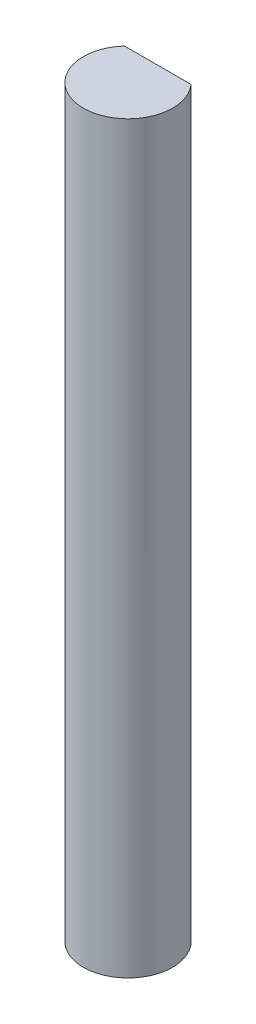
ISO-10303-21;
HEADER;
FILE_DESCRIPTION(('STEP AP214'),'2;1');
FILE_NAME('part.step','',(''),(''),'','','');
FILE_SCHEMA(('AUTOMOTIVE_DESIGN { 1 0 10303 214 1 1 1 1 }'));
ENDSEC;
DATA;
#1=APPLICATION_CONTEXT('core data for automotive mechanical design processes');
#2=APPLICATION_PROTOCOL_DEFINITION('international standard','automotive_design',2000,#1);
#3=PRODUCT_CONTEXT('',#1,'mechanical');
#4=PRODUCT('Part','Part','',(#3));
#5=PRODUCT_RELATED_PRODUCT_CATEGORY('part','',(#4));
#6=PRODUCT_DEFINITION_FORMATION('','',#4);
#7=PRODUCT_DEFINITION_CONTEXT('part definition',#1,'design');
#8=PRODUCT_DEFINITION('design','',#6,#7);
#9=PRODUCT_DEFINITION_SHAPE('','',#8);
#10=(LENGTH_UNIT() NAMED_UNIT(*) SI_UNIT(.MILLI.,.METRE.));
#11=(NAMED_UNIT(*) PLANE_ANGLE_UNIT() SI_UNIT($,.RADIAN.));
#12=(NAMED_UNIT(*) SI_UNIT($,.STERADIAN.) SOLID_ANGLE_UNIT());
#13=UNCERTAINTY_MEASURE_WITH_UNIT(LENGTH_MEASURE(1.E-05),#10,'distance_accuracy_value','');
#14=(GEOMETRIC_REPRESENTATION_CONTEXT(3) GLOBAL_UNCERTAINTY_ASSIGNED_CONTEXT((#13)) GLOBAL_UNIT_ASSIGNED_CONTEXT((#10,
#11,#12)) REPRESENTATION_CONTEXT('',''));
#15=CARTESIAN_POINT('',(0.,0.,0.));
#16=DIRECTION('',(0.,0.,1.));
#17=DIRECTION('',(1.,0.,0.));
#18=AXIS2_PLACEMENT_3D('',#15,#16,#17);
#19=CARTESIAN_POINT('',(0.,50.,0.));
#20=DIRECTION('',(0.,-1.,0.));
#21=DIRECTION('',(0.,0.,-1.));
#22=AXIS2_PLACEMENT_3D('',#19,#20,#21);
#23=CYLINDRICAL_SURFACE('',#22,3.);
#24=CARTESIAN_POINT('',(0.,50.,0.));
#25=DIRECTION('',(0.,1.,0.));
#26=DIRECTION('',(0.,0.,1.));
#27=AXIS2_PLACEMENT_3D('',#24,#25,#26);
#28=CIRCLE('',#27,3.);
#29=CARTESIAN_POINT('',(-2.23606797749979,50.,-2.));
#30=VERTEX_POINT('',#29);
#31=CARTESIAN_POINT('',(2.23606797749979,50.,-2.));
#32=VERTEX_POINT('',#31);
#33=EDGE_CURVE('E11',#30,#32,#28,.T.);
#34=ORIENTED_EDGE('',*,*,#33,.F.);
#35=DIRECTION('',(0.,1.,0.));
#36=VECTOR('',#35,1.);
#37=CARTESIAN_POINT('',(-2.23606797749979,38.,-2.));
#38=LINE('',#37,#36);
#39=CARTESIAN_POINT('',(-2.23606797749979,38.,-2.));
#40=VERTEX_POINT('',#39);
#41=EDGE_CURVE('E58',#40,#30,#38,.T.);
#42=ORIENTED_EDGE('',*,*,#41,.F.);
#43=CARTESIAN_POINT('',(0.,38.,0.));
#44=DIRECTION('',(0.,1.,0.));
#45=DIRECTION('',(0.,0.,1.));
#46=AXIS2_PLACEMENT_3D('',#43,#44,#45);
#47=CIRCLE('',#46,3.);
#48=CARTESIAN_POINT('',(2.23606797749979,38.,-2.));
#49=VERTEX_POINT('',#48);
#50=EDGE_CURVE('E74',#49,#40,#47,.T.);
#51=ORIENTED_EDGE('',*,*,#50,.F.);
#52=DIRECTION('',(0.,1.,0.));
#53=VECTOR('',#52,1.);
#54=CARTESIAN_POINT('',(2.23606797749979,38.,-2.));
#55=LINE('',#54,#53);
#56=EDGE_CURVE('E64',#49,#32,#55,.T.);
#57=ORIENTED_EDGE('',*,*,#56,.T.);
#58=EDGE_LOOP('',(#34,#42,#51,#57));
#59=FACE_BOUND('',#58,.T.);
#60=CARTESIAN_POINT('',(0.,0.,0.));
#61=DIRECTION('',(0.,1.,0.));
#62=DIRECTION('',(0.,0.,1.));
#63=AXIS2_PLACEMENT_3D('',#60,#61,#62);
#64=CIRCLE('',#63,3.);
#65=CARTESIAN_POINT('',(0.,0.,3.));
#66=VERTEX_POINT('',#65);
#67=EDGE_CURVE('E46',#66,#66,#64,.T.);
#68=ORIENTED_EDGE('',*,*,#67,.T.);
#69=EDGE_LOOP('',(#68));
#70=FACE_BOUND('',#69,.T.);
#71=ADVANCED_FACE('F43',(#59,#70),#23,.T.);
#72=CARTESIAN_POINT('',(0.,50.,0.));
#73=DIRECTION('',(0.,1.,0.));
#74=DIRECTION('',(0.,0.,1.));
#75=AXIS2_PLACEMENT_3D('',#72,#73,#74);
#76=PLANE('',#75);
#77=DIRECTION('',(1.,0.,0.));
#78=VECTOR('',#77,1.);
#79=CARTESIAN_POINT('',(-2.23606797749979,50.,-2.));
#80=LINE('',#79,#78);
#81=EDGE_CURVE('E69',#30,#32,#80,.T.);
#82=ORIENTED_EDGE('',*,*,#81,.F.);
#83=ORIENTED_EDGE('',*,*,#33,.T.);
#84=EDGE_LOOP('',(#82,#83));
#85=FACE_BOUND('',#84,.T.);
#86=ADVANCED_FACE('F81',(#85),#76,.T.);
#87=CARTESIAN_POINT('',(0.,0.,0.));
#88=DIRECTION('',(0.,1.,0.));
#89=DIRECTION('',(0.,0.,1.));
#90=AXIS2_PLACEMENT_3D('',#87,#88,#89);
#91=PLANE('',#90);
#92=ORIENTED_EDGE('',*,*,#67,.F.);
#93=EDGE_LOOP('',(#92));
#94=FACE_BOUND('',#93,.T.);
#95=ADVANCED_FACE('F83',(#94),#91,.F.);
#96=CARTESIAN_POINT('',(-2.23606797749979,38.,-2.));
#97=DIRECTION('',(0.,0.,1.));
#98=DIRECTION('',(1.,0.,0.));
#99=AXIS2_PLACEMENT_3D('',#96,#97,#98);
#100=PLANE('',#99);
#101=ORIENTED_EDGE('',*,*,#81,.T.);
#102=ORIENTED_EDGE('',*,*,#56,.F.);
#103=DIRECTION('',(1.,0.,0.));
#104=VECTOR('',#103,1.);
#105=CARTESIAN_POINT('',(-2.23606797749979,38.,-2.));
#106=LINE('',#105,#104);
#107=EDGE_CURVE('E98',#40,#49,#106,.T.);
#108=ORIENTED_EDGE('',*,*,#107,.F.);
#109=ORIENTED_EDGE('',*,*,#41,.T.);
#110=EDGE_LOOP('',(#101,#102,#108,#109));
#111=FACE_BOUND('',#110,.T.);
#112=ADVANCED_FACE('F70',(#111),#100,.F.);
#113=CARTESIAN_POINT('',(0.,38.,0.));
#114=DIRECTION('',(0.,1.,0.));
#115=DIRECTION('',(0.,0.,1.));
#116=AXIS2_PLACEMENT_3D('',#113,#114,#115);
#117=PLANE('',#116);
#118=ORIENTED_EDGE('',*,*,#50,.T.);
#119=ORIENTED_EDGE('',*,*,#107,.T.);
#120=EDGE_LOOP('',(#118,#119));
#121=FACE_BOUND('',#120,.T.);
#122=ADVANCED_FACE('F93',(#121),#117,.T.);
#123=CLOSED_SHELL('',(#71,#86,#95,#112,#122));
#124=MANIFOLD_SOLID_BREP('B2',#123);
#125=ADVANCED_BREP_SHAPE_REPRESENTATION('',(#18,#124),#14);
#126=SHAPE_DEFINITION_REPRESENTATION(#9,#125);
ENDSEC;
END-ISO-10303-21;
